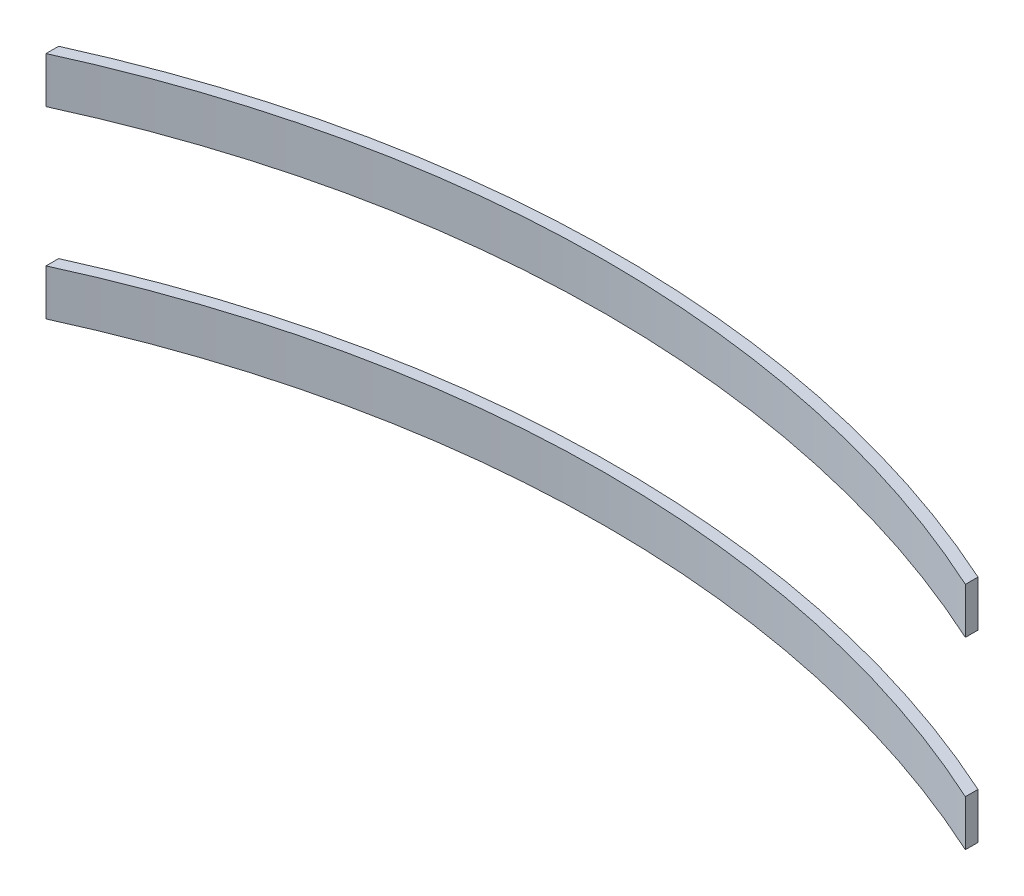
ISO-10303-21;
HEADER;
FILE_DESCRIPTION(('STEP AP214'),'2;1');
FILE_NAME('part.step','',(''),(''),'','','');
FILE_SCHEMA(('AUTOMOTIVE_DESIGN { 1 0 10303 214 1 1 1 1 }'));
ENDSEC;
DATA;
#1=APPLICATION_CONTEXT('core data for automotive mechanical design processes');
#2=APPLICATION_PROTOCOL_DEFINITION('international standard','automotive_design',2000,#1);
#3=PRODUCT_CONTEXT('',#1,'mechanical');
#4=PRODUCT('Part','Part','',(#3));
#5=PRODUCT_RELATED_PRODUCT_CATEGORY('part','',(#4));
#6=PRODUCT_DEFINITION_FORMATION('','',#4);
#7=PRODUCT_DEFINITION_CONTEXT('part definition',#1,'design');
#8=PRODUCT_DEFINITION('design','',#6,#7);
#9=PRODUCT_DEFINITION_SHAPE('','',#8);
#10=(LENGTH_UNIT() NAMED_UNIT(*) SI_UNIT(.MILLI.,.METRE.));
#11=(NAMED_UNIT(*) PLANE_ANGLE_UNIT() SI_UNIT($,.RADIAN.));
#12=(NAMED_UNIT(*) SI_UNIT($,.STERADIAN.) SOLID_ANGLE_UNIT());
#13=UNCERTAINTY_MEASURE_WITH_UNIT(LENGTH_MEASURE(1.E-05),#10,'distance_accuracy_value','');
#14=(GEOMETRIC_REPRESENTATION_CONTEXT(3) GLOBAL_UNCERTAINTY_ASSIGNED_CONTEXT((#13)) GLOBAL_UNIT_ASSIGNED_CONTEXT((#10,
#11,#12)) REPRESENTATION_CONTEXT('',''));
#15=CARTESIAN_POINT('',(0.,0.,0.));
#16=DIRECTION('',(0.,0.,1.));
#17=DIRECTION('',(1.,0.,0.));
#18=AXIS2_PLACEMENT_3D('',#15,#16,#17);
#19=CARTESIAN_POINT('',(20.,10.,-44.1842732202307));
#20=DIRECTION('',(1.,0.,0.));
#21=DIRECTION('',(0.,0.,-1.));
#22=AXIS2_PLACEMENT_3D('',#19,#20,#21);
#23=PLANE('',#22);
#24=DIRECTION('',(0.,0.,1.));
#25=VECTOR('',#24,1.);
#26=CARTESIAN_POINT('',(20.,8.,-44.1842732202307));
#27=LINE('',#26,#25);
#28=CARTESIAN_POINT('',(20.,8.,-44.1842732202307));
#29=VERTEX_POINT('',#28);
#30=CARTESIAN_POINT('',(20.,8.,-43.6348484585429));
#31=VERTEX_POINT('',#30);
#32=EDGE_CURVE('E107',#29,#31,#27,.T.);
#33=ORIENTED_EDGE('',*,*,#32,.F.);
#34=DIRECTION('',(0.,-1.,0.));
#35=VECTOR('',#34,1.);
#36=CARTESIAN_POINT('',(20.,10.,-44.1842732202307));
#37=LINE('',#36,#35);
#38=CARTESIAN_POINT('',(20.,10.,-44.1842732202307));
#39=VERTEX_POINT('',#38);
#40=EDGE_CURVE('E12',#39,#29,#37,.T.);
#41=ORIENTED_EDGE('',*,*,#40,.F.);
#42=DIRECTION('',(0.,0.,1.));
#43=VECTOR('',#42,1.);
#44=CARTESIAN_POINT('',(20.,10.,-44.1842732202307));
#45=LINE('',#44,#43);
#46=CARTESIAN_POINT('',(20.,10.,-43.6348484585429));
#47=VERTEX_POINT('',#46);
#48=EDGE_CURVE('E102',#39,#47,#45,.T.);
#49=ORIENTED_EDGE('',*,*,#48,.T.);
#50=DIRECTION('',(0.,-1.,0.));
#51=VECTOR('',#50,1.);
#52=CARTESIAN_POINT('',(20.,10.,-43.6348484585429));
#53=LINE('',#52,#51);
#54=EDGE_CURVE('E45',#47,#31,#53,.T.);
#55=ORIENTED_EDGE('',*,*,#54,.T.);
#56=EDGE_LOOP('',(#33,#41,#49,#55));
#57=FACE_BOUND('',#56,.T.);
#58=ADVANCED_FACE('F42',(#57),#23,.T.);
#59=CARTESIAN_POINT('',(0.,10.,0.));
#60=DIRECTION('',(0.,-1.,0.));
#61=DIRECTION('',(0.,0.,-1.));
#62=AXIS2_PLACEMENT_3D('',#59,#60,#61);
#63=CYLINDRICAL_SURFACE('',#62,48.5);
#64=CARTESIAN_POINT('',(0.,8.,0.));
#65=DIRECTION('',(0.,1.,0.));
#66=DIRECTION('',(0.,0.,1.));
#67=AXIS2_PLACEMENT_3D('',#64,#65,#66);
#68=CIRCLE('',#67,48.5);
#69=CARTESIAN_POINT('',(-20.,8.,-44.1842732202308));
#70=VERTEX_POINT('',#69);
#71=EDGE_CURVE('E75',#29,#70,#68,.T.);
#72=ORIENTED_EDGE('',*,*,#71,.T.);
#73=DIRECTION('',(0.,-1.,0.));
#74=VECTOR('',#73,1.);
#75=CARTESIAN_POINT('',(-20.,10.,-44.1842732202308));
#76=LINE('',#75,#74);
#77=CARTESIAN_POINT('',(-20.,10.,-44.1842732202308));
#78=VERTEX_POINT('',#77);
#79=EDGE_CURVE('E51',#78,#70,#76,.T.);
#80=ORIENTED_EDGE('',*,*,#79,.F.);
#81=CARTESIAN_POINT('',(0.,10.,0.));
#82=DIRECTION('',(0.,1.,0.));
#83=DIRECTION('',(0.,0.,1.));
#84=AXIS2_PLACEMENT_3D('',#81,#82,#83);
#85=CIRCLE('',#84,48.5);
#86=EDGE_CURVE('E92',#39,#78,#85,.T.);
#87=ORIENTED_EDGE('',*,*,#86,.F.);
#88=ORIENTED_EDGE('',*,*,#40,.T.);
#89=EDGE_LOOP('',(#72,#80,#87,#88));
#90=FACE_BOUND('',#89,.T.);
#91=ADVANCED_FACE('F117',(#90),#63,.T.);
#92=CARTESIAN_POINT('',(-20.,10.,-44.1842732202308));
#93=DIRECTION('',(1.,0.,0.));
#94=DIRECTION('',(0.,0.,-1.));
#95=AXIS2_PLACEMENT_3D('',#92,#93,#94);
#96=PLANE('',#95);
#97=DIRECTION('',(0.,0.,1.));
#98=VECTOR('',#97,1.);
#99=CARTESIAN_POINT('',(-20.,8.,-44.1842732202308));
#100=LINE('',#99,#98);
#101=CARTESIAN_POINT('',(-20.,8.,-43.6348484585429));
#102=VERTEX_POINT('',#101);
#103=EDGE_CURVE('E99',#70,#102,#100,.T.);
#104=ORIENTED_EDGE('',*,*,#103,.T.);
#105=DIRECTION('',(0.,-1.,0.));
#106=VECTOR('',#105,1.);
#107=CARTESIAN_POINT('',(-20.,10.,-43.6348484585429));
#108=LINE('',#107,#106);
#109=CARTESIAN_POINT('',(-20.,10.,-43.6348484585429));
#110=VERTEX_POINT('',#109);
#111=EDGE_CURVE('E96',#110,#102,#108,.T.);
#112=ORIENTED_EDGE('',*,*,#111,.F.);
#113=DIRECTION('',(0.,0.,1.));
#114=VECTOR('',#113,1.);
#115=CARTESIAN_POINT('',(-20.,10.,-44.1842732202308));
#116=LINE('',#115,#114);
#117=EDGE_CURVE('E87',#78,#110,#116,.T.);
#118=ORIENTED_EDGE('',*,*,#117,.F.);
#119=ORIENTED_EDGE('',*,*,#79,.T.);
#120=EDGE_LOOP('',(#104,#112,#118,#119));
#121=FACE_BOUND('',#120,.T.);
#122=ADVANCED_FACE('F97',(#121),#96,.F.);
#123=CARTESIAN_POINT('',(0.,10.,0.));
#124=DIRECTION('',(0.,-1.,0.));
#125=DIRECTION('',(0.,0.,-1.));
#126=AXIS2_PLACEMENT_3D('',#123,#124,#125);
#127=CYLINDRICAL_SURFACE('',#126,48.);
#128=CARTESIAN_POINT('',(0.,8.,0.));
#129=DIRECTION('',(0.,1.,0.));
#130=DIRECTION('',(0.,0.,1.));
#131=AXIS2_PLACEMENT_3D('',#128,#129,#130);
#132=CIRCLE('',#131,48.);
#133=EDGE_CURVE('E110',#31,#102,#132,.T.);
#134=ORIENTED_EDGE('',*,*,#133,.F.);
#135=ORIENTED_EDGE('',*,*,#54,.F.);
#136=CARTESIAN_POINT('',(0.,10.,0.));
#137=DIRECTION('',(0.,1.,0.));
#138=DIRECTION('',(0.,0.,1.));
#139=AXIS2_PLACEMENT_3D('',#136,#137,#138);
#140=CIRCLE('',#139,48.);
#141=EDGE_CURVE('E91',#47,#110,#140,.T.);
#142=ORIENTED_EDGE('',*,*,#141,.T.);
#143=ORIENTED_EDGE('',*,*,#111,.T.);
#144=EDGE_LOOP('',(#134,#135,#142,#143));
#145=FACE_BOUND('',#144,.T.);
#146=ADVANCED_FACE('F101',(#145),#127,.F.);
#147=CARTESIAN_POINT('',(0.,10.,0.));
#148=DIRECTION('',(0.,1.,0.));
#149=DIRECTION('',(0.,0.,1.));
#150=AXIS2_PLACEMENT_3D('',#147,#148,#149);
#151=PLANE('',#150);
#152=ORIENTED_EDGE('',*,*,#48,.F.);
#153=ORIENTED_EDGE('',*,*,#86,.T.);
#154=ORIENTED_EDGE('',*,*,#117,.T.);
#155=ORIENTED_EDGE('',*,*,#141,.F.);
#156=EDGE_LOOP('',(#152,#153,#154,#155));
#157=FACE_BOUND('',#156,.T.);
#158=ADVANCED_FACE('F90',(#157),#151,.T.);
#159=CARTESIAN_POINT('',(0.,8.,0.));
#160=DIRECTION('',(0.,1.,0.));
#161=DIRECTION('',(0.,0.,1.));
#162=AXIS2_PLACEMENT_3D('',#159,#160,#161);
#163=PLANE('',#162);
#164=ORIENTED_EDGE('',*,*,#32,.T.);
#165=ORIENTED_EDGE('',*,*,#133,.T.);
#166=ORIENTED_EDGE('',*,*,#103,.F.);
#167=ORIENTED_EDGE('',*,*,#71,.F.);
#168=EDGE_LOOP('',(#164,#165,#166,#167));
#169=FACE_BOUND('',#168,.T.);
#170=ADVANCED_FACE('F115',(#169),#163,.F.);
#171=CLOSED_SHELL('',(#58,#91,#122,#146,#158,#170));
#172=MANIFOLD_SOLID_BREP('B2',#171);
#173=CARTESIAN_POINT('',(-20.,2.,-44.1842732202308));
#174=DIRECTION('',(1.,0.,0.));
#175=DIRECTION('',(0.,0.,-1.));
#176=AXIS2_PLACEMENT_3D('',#173,#174,#175);
#177=PLANE('',#176);
#178=DIRECTION('',(0.,0.,1.));
#179=VECTOR('',#178,1.);
#180=CARTESIAN_POINT('',(-20.,0.,-44.1842732202308));
#181=LINE('',#180,#179);
#182=CARTESIAN_POINT('',(-20.,0.,-44.1842732202307));
#183=VERTEX_POINT('',#182);
#184=CARTESIAN_POINT('',(-20.,0.,-43.6348484585429));
#185=VERTEX_POINT('',#184);
#186=EDGE_CURVE('E228',#183,#185,#181,.T.);
#187=ORIENTED_EDGE('',*,*,#186,.T.);
#188=DIRECTION('',(0.,-1.,0.));
#189=VECTOR('',#188,1.);
#190=CARTESIAN_POINT('',(-20.,2.,-43.6348484585429));
#191=LINE('',#190,#189);
#192=CARTESIAN_POINT('',(-20.,2.,-43.6348484585429));
#193=VERTEX_POINT('',#192);
#194=EDGE_CURVE('E40',#193,#185,#191,.T.);
#195=ORIENTED_EDGE('',*,*,#194,.F.);
#196=DIRECTION('',(0.,0.,1.));
#197=VECTOR('',#196,1.);
#198=CARTESIAN_POINT('',(-20.,2.,-44.1842732202308));
#199=LINE('',#198,#197);
#200=CARTESIAN_POINT('',(-20.,2.,-44.1842732202307));
#201=VERTEX_POINT('',#200);
#202=EDGE_CURVE('E205',#201,#193,#199,.T.);
#203=ORIENTED_EDGE('',*,*,#202,.F.);
#204=DIRECTION('',(0.,-1.,0.));
#205=VECTOR('',#204,1.);
#206=CARTESIAN_POINT('',(-20.,2.,-44.1842732202307));
#207=LINE('',#206,#205);
#208=EDGE_CURVE('E181',#201,#183,#207,.T.);
#209=ORIENTED_EDGE('',*,*,#208,.T.);
#210=EDGE_LOOP('',(#187,#195,#203,#209));
#211=FACE_BOUND('',#210,.T.);
#212=ADVANCED_FACE('F165',(#211),#177,.F.);
#213=CARTESIAN_POINT('',(0.,2.,0.));
#214=DIRECTION('',(0.,-1.,0.));
#215=DIRECTION('',(0.,0.,-1.));
#216=AXIS2_PLACEMENT_3D('',#213,#214,#215);
#217=CYLINDRICAL_SURFACE('',#216,48.);
#218=CARTESIAN_POINT('',(0.,0.,0.));
#219=DIRECTION('',(0.,1.,0.));
#220=DIRECTION('',(0.,0.,1.));
#221=AXIS2_PLACEMENT_3D('',#218,#219,#220);
#222=CIRCLE('',#221,48.);
#223=CARTESIAN_POINT('',(20.,0.,-43.6348484585429));
#224=VERTEX_POINT('',#223);
#225=EDGE_CURVE('E214',#224,#185,#222,.T.);
#226=ORIENTED_EDGE('',*,*,#225,.F.);
#227=DIRECTION('',(0.,-1.,0.));
#228=VECTOR('',#227,1.);
#229=CARTESIAN_POINT('',(20.,2.,-43.6348484585429));
#230=LINE('',#229,#228);
#231=CARTESIAN_POINT('',(20.,2.,-43.6348484585429));
#232=VERTEX_POINT('',#231);
#233=EDGE_CURVE('E173',#232,#224,#230,.T.);
#234=ORIENTED_EDGE('',*,*,#233,.F.);
#235=CARTESIAN_POINT('',(0.,2.,0.));
#236=DIRECTION('',(0.,1.,0.));
#237=DIRECTION('',(0.,0.,1.));
#238=AXIS2_PLACEMENT_3D('',#235,#236,#237);
#239=CIRCLE('',#238,48.);
#240=EDGE_CURVE('E212',#232,#193,#239,.T.);
#241=ORIENTED_EDGE('',*,*,#240,.T.);
#242=ORIENTED_EDGE('',*,*,#194,.T.);
#243=EDGE_LOOP('',(#226,#234,#241,#242));
#244=FACE_BOUND('',#243,.T.);
#245=ADVANCED_FACE('F211',(#244),#217,.F.);
#246=CARTESIAN_POINT('',(20.,2.,-44.1842732202307));
#247=DIRECTION('',(1.,0.,0.));
#248=DIRECTION('',(0.,0.,-1.));
#249=AXIS2_PLACEMENT_3D('',#246,#247,#248);
#250=PLANE('',#249);
#251=DIRECTION('',(0.,0.,1.));
#252=VECTOR('',#251,1.);
#253=CARTESIAN_POINT('',(20.,0.,-44.1842732202307));
#254=LINE('',#253,#252);
#255=CARTESIAN_POINT('',(20.,0.,-44.1842732202307));
#256=VERTEX_POINT('',#255);
#257=EDGE_CURVE('E231',#256,#224,#254,.T.);
#258=ORIENTED_EDGE('',*,*,#257,.F.);
#259=DIRECTION('',(0.,-1.,0.));
#260=VECTOR('',#259,1.);
#261=CARTESIAN_POINT('',(20.,2.,-44.1842732202307));
#262=LINE('',#261,#260);
#263=CARTESIAN_POINT('',(20.,2.,-44.1842732202307));
#264=VERTEX_POINT('',#263);
#265=EDGE_CURVE('E194',#264,#256,#262,.T.);
#266=ORIENTED_EDGE('',*,*,#265,.F.);
#267=DIRECTION('',(0.,0.,1.));
#268=VECTOR('',#267,1.);
#269=CARTESIAN_POINT('',(20.,2.,-44.1842732202307));
#270=LINE('',#269,#268);
#271=EDGE_CURVE('E220',#264,#232,#270,.T.);
#272=ORIENTED_EDGE('',*,*,#271,.T.);
#273=ORIENTED_EDGE('',*,*,#233,.T.);
#274=EDGE_LOOP('',(#258,#266,#272,#273));
#275=FACE_BOUND('',#274,.T.);
#276=ADVANCED_FACE('F222',(#275),#250,.T.);
#277=CARTESIAN_POINT('',(0.,2.,0.));
#278=DIRECTION('',(0.,-1.,0.));
#279=DIRECTION('',(0.,0.,-1.));
#280=AXIS2_PLACEMENT_3D('',#277,#278,#279);
#281=CYLINDRICAL_SURFACE('',#280,48.5);
#282=CARTESIAN_POINT('',(0.,0.,0.));
#283=DIRECTION('',(0.,-1.,0.));
#284=DIRECTION('',(0.,0.,-1.));
#285=AXIS2_PLACEMENT_3D('',#282,#283,#284);
#286=CIRCLE('',#285,48.5);
#287=EDGE_CURVE('E233',#183,#256,#286,.T.);
#288=ORIENTED_EDGE('',*,*,#287,.F.);
#289=ORIENTED_EDGE('',*,*,#208,.F.);
#290=CARTESIAN_POINT('',(0.,2.,0.));
#291=DIRECTION('',(0.,-1.,0.));
#292=DIRECTION('',(0.,0.,-1.));
#293=AXIS2_PLACEMENT_3D('',#290,#291,#292);
#294=CIRCLE('',#293,48.5);
#295=EDGE_CURVE('E223',#201,#264,#294,.T.);
#296=ORIENTED_EDGE('',*,*,#295,.T.);
#297=ORIENTED_EDGE('',*,*,#265,.T.);
#298=EDGE_LOOP('',(#288,#289,#296,#297));
#299=FACE_BOUND('',#298,.T.);
#300=ADVANCED_FACE('F239',(#299),#281,.T.);
#301=CARTESIAN_POINT('',(0.,2.,0.));
#302=DIRECTION('',(0.,1.,0.));
#303=DIRECTION('',(0.,0.,1.));
#304=AXIS2_PLACEMENT_3D('',#301,#302,#303);
#305=PLANE('',#304);
#306=ORIENTED_EDGE('',*,*,#202,.T.);
#307=ORIENTED_EDGE('',*,*,#240,.F.);
#308=ORIENTED_EDGE('',*,*,#271,.F.);
#309=ORIENTED_EDGE('',*,*,#295,.F.);
#310=EDGE_LOOP('',(#306,#307,#308,#309));
#311=FACE_BOUND('',#310,.T.);
#312=ADVANCED_FACE('F219',(#311),#305,.T.);
#313=CARTESIAN_POINT('',(0.,0.,0.));
#314=DIRECTION('',(0.,1.,0.));
#315=DIRECTION('',(0.,0.,1.));
#316=AXIS2_PLACEMENT_3D('',#313,#314,#315);
#317=PLANE('',#316);
#318=ORIENTED_EDGE('',*,*,#186,.F.);
#319=ORIENTED_EDGE('',*,*,#287,.T.);
#320=ORIENTED_EDGE('',*,*,#257,.T.);
#321=ORIENTED_EDGE('',*,*,#225,.T.);
#322=EDGE_LOOP('',(#318,#319,#320,#321));
#323=FACE_BOUND('',#322,.T.);
#324=ADVANCED_FACE('F238',(#323),#317,.F.);
#325=CLOSED_SHELL('',(#212,#245,#276,#300,#312,#324));
#326=MANIFOLD_SOLID_BREP('B6',#325);
#327=ADVANCED_BREP_SHAPE_REPRESENTATION('',(#18,#172,#326),#14);
#328=SHAPE_DEFINITION_REPRESENTATION(#9,#327);
ENDSEC;
END-ISO-10303-21;
